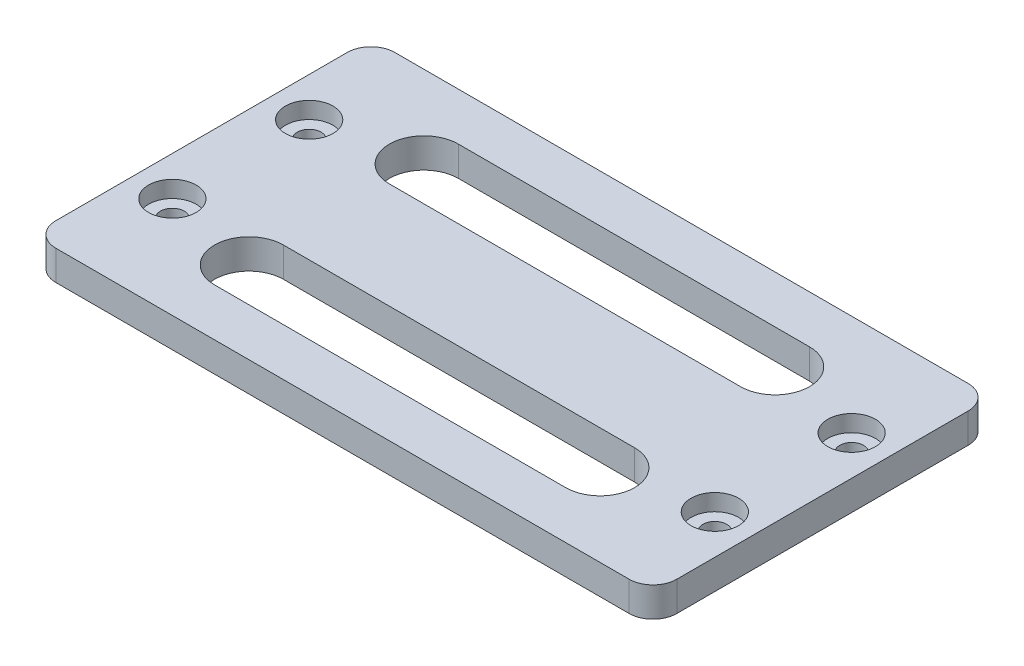
ISO-10303-21;
HEADER;
FILE_DESCRIPTION(('STEP AP214'),'2;1');
FILE_NAME('part.step','',(''),(''),'','','');
FILE_SCHEMA(('AUTOMOTIVE_DESIGN { 1 0 10303 214 1 1 1 1 }'));
ENDSEC;
DATA;
#1=APPLICATION_CONTEXT('core data for automotive mechanical design processes');
#2=APPLICATION_PROTOCOL_DEFINITION('international standard','automotive_design',2000,#1);
#3=PRODUCT_CONTEXT('',#1,'mechanical');
#4=PRODUCT('Part','Part','',(#3));
#5=PRODUCT_RELATED_PRODUCT_CATEGORY('part','',(#4));
#6=PRODUCT_DEFINITION_FORMATION('','',#4);
#7=PRODUCT_DEFINITION_CONTEXT('part definition',#1,'design');
#8=PRODUCT_DEFINITION('design','',#6,#7);
#9=PRODUCT_DEFINITION_SHAPE('','',#8);
#10=(LENGTH_UNIT() NAMED_UNIT(*) SI_UNIT(.MILLI.,.METRE.));
#11=(NAMED_UNIT(*) PLANE_ANGLE_UNIT() SI_UNIT($,.RADIAN.));
#12=(NAMED_UNIT(*) SI_UNIT($,.STERADIAN.) SOLID_ANGLE_UNIT());
#13=UNCERTAINTY_MEASURE_WITH_UNIT(LENGTH_MEASURE(1.E-05),#10,'distance_accuracy_value','');
#14=(GEOMETRIC_REPRESENTATION_CONTEXT(3) GLOBAL_UNCERTAINTY_ASSIGNED_CONTEXT((#13)) GLOBAL_UNIT_ASSIGNED_CONTEXT((#10,
#11,#12)) REPRESENTATION_CONTEXT('',''));
#15=CARTESIAN_POINT('',(0.,0.,0.));
#16=DIRECTION('',(0.,0.,1.));
#17=DIRECTION('',(1.,0.,0.));
#18=AXIS2_PLACEMENT_3D('',#15,#16,#17);
#19=CARTESIAN_POINT('',(-22.8,1.1,3.2));
#20=DIRECTION('',(0.,-1.,0.));
#21=DIRECTION('',(0.,0.,-1.));
#22=AXIS2_PLACEMENT_3D('',#19,#20,#21);
#23=CYLINDRICAL_SURFACE('',#22,1.);
#24=CARTESIAN_POINT('',(-22.8,1.1,3.2));
#25=DIRECTION('',(0.,-1.,0.));
#26=DIRECTION('',(0.,0.,-1.));
#27=AXIS2_PLACEMENT_3D('',#24,#25,#26);
#28=CIRCLE('',#27,1.);
#29=CARTESIAN_POINT('',(-22.8,1.1,2.2));
#30=VERTEX_POINT('',#29);
#31=EDGE_CURVE('E252',#30,#30,#28,.T.);
#32=ORIENTED_EDGE('',*,*,#31,.F.);
#33=EDGE_LOOP('',(#32));
#34=FACE_BOUND('',#33,.T.);
#35=CARTESIAN_POINT('',(-22.8,0.,3.2));
#36=DIRECTION('',(0.,-1.,0.));
#37=DIRECTION('',(0.,0.,-1.));
#38=AXIS2_PLACEMENT_3D('',#35,#36,#37);
#39=CIRCLE('',#38,1.);
#40=CARTESIAN_POINT('',(-22.8,0.,2.2));
#41=VERTEX_POINT('',#40);
#42=EDGE_CURVE('E247',#41,#41,#39,.F.);
#43=ORIENTED_EDGE('',*,*,#42,.F.);
#44=EDGE_LOOP('',(#43));
#45=FACE_BOUND('',#44,.T.);
#46=ADVANCED_FACE('F17',(#34,#45),#23,.F.);
#47=CARTESIAN_POINT('',(22.8,1.1,3.2));
#48=DIRECTION('',(0.,-1.,0.));
#49=DIRECTION('',(0.,0.,-1.));
#50=AXIS2_PLACEMENT_3D('',#47,#48,#49);
#51=CYLINDRICAL_SURFACE('',#50,1.);
#52=CARTESIAN_POINT('',(22.8,1.1,3.2));
#53=DIRECTION('',(0.,-1.,0.));
#54=DIRECTION('',(0.,0.,-1.));
#55=AXIS2_PLACEMENT_3D('',#52,#53,#54);
#56=CIRCLE('',#55,1.);
#57=CARTESIAN_POINT('',(22.8,1.1,2.2));
#58=VERTEX_POINT('',#57);
#59=EDGE_CURVE('E21',#58,#58,#56,.T.);
#60=ORIENTED_EDGE('',*,*,#59,.F.);
#61=EDGE_LOOP('',(#60));
#62=FACE_BOUND('',#61,.T.);
#63=CARTESIAN_POINT('',(22.8,0.,3.2));
#64=DIRECTION('',(0.,-1.,0.));
#65=DIRECTION('',(0.,0.,-1.));
#66=AXIS2_PLACEMENT_3D('',#63,#64,#65);
#67=CIRCLE('',#66,1.);
#68=CARTESIAN_POINT('',(22.8,0.,2.2));
#69=VERTEX_POINT('',#68);
#70=EDGE_CURVE('E244',#69,#69,#67,.F.);
#71=ORIENTED_EDGE('',*,*,#70,.F.);
#72=EDGE_LOOP('',(#71));
#73=FACE_BOUND('',#72,.T.);
#74=ADVANCED_FACE('F262',(#62,#73),#51,.F.);
#75=CARTESIAN_POINT('',(-22.8,1.1,-8.3));
#76=DIRECTION('',(0.,-1.,0.));
#77=DIRECTION('',(0.,0.,-1.));
#78=AXIS2_PLACEMENT_3D('',#75,#76,#77);
#79=CYLINDRICAL_SURFACE('',#78,1.);
#80=CARTESIAN_POINT('',(-22.8,1.1,-8.3));
#81=DIRECTION('',(0.,-1.,0.));
#82=DIRECTION('',(0.,0.,-1.));
#83=AXIS2_PLACEMENT_3D('',#80,#81,#82);
#84=CIRCLE('',#83,1.);
#85=CARTESIAN_POINT('',(-22.8,1.1,-9.3));
#86=VERTEX_POINT('',#85);
#87=EDGE_CURVE('E250',#86,#86,#84,.T.);
#88=ORIENTED_EDGE('',*,*,#87,.F.);
#89=EDGE_LOOP('',(#88));
#90=FACE_BOUND('',#89,.T.);
#91=CARTESIAN_POINT('',(-22.8,0.,-8.3));
#92=DIRECTION('',(0.,-1.,0.));
#93=DIRECTION('',(0.,0.,-1.));
#94=AXIS2_PLACEMENT_3D('',#91,#92,#93);
#95=CIRCLE('',#94,1.);
#96=CARTESIAN_POINT('',(-22.8,0.,-9.3));
#97=VERTEX_POINT('',#96);
#98=EDGE_CURVE('E241',#97,#97,#95,.F.);
#99=ORIENTED_EDGE('',*,*,#98,.F.);
#100=EDGE_LOOP('',(#99));
#101=FACE_BOUND('',#100,.T.);
#102=ADVANCED_FACE('F265',(#90,#101),#79,.F.);
#103=CARTESIAN_POINT('',(20.776,1.1,1.176));
#104=DIRECTION('',(0.,1.,0.));
#105=DIRECTION('',(0.,0.,1.));
#106=AXIS2_PLACEMENT_3D('',#103,#104,#105);
#107=PLANE('',#106);
#108=ORIENTED_EDGE('',*,*,#59,.T.);
#109=EDGE_LOOP('',(#108));
#110=FACE_BOUND('',#109,.T.);
#111=CARTESIAN_POINT('',(22.8,1.1,3.2));
#112=DIRECTION('',(0.,1.,0.));
#113=DIRECTION('',(0.,0.,1.));
#114=AXIS2_PLACEMENT_3D('',#111,#112,#113);
#115=CIRCLE('',#114,2.);
#116=CARTESIAN_POINT('',(22.8,1.1,5.2));
#117=VERTEX_POINT('',#116);
#118=EDGE_CURVE('E153',#117,#117,#115,.F.);
#119=ORIENTED_EDGE('',*,*,#118,.F.);
#120=EDGE_LOOP('',(#119));
#121=FACE_BOUND('',#120,.T.);
#122=ADVANCED_FACE('F259',(#110,#121),#107,.T.);
#123=CARTESIAN_POINT('',(-24.824,1.1,1.176));
#124=DIRECTION('',(0.,1.,0.));
#125=DIRECTION('',(0.,0.,1.));
#126=AXIS2_PLACEMENT_3D('',#123,#124,#125);
#127=PLANE('',#126);
#128=ORIENTED_EDGE('',*,*,#31,.T.);
#129=EDGE_LOOP('',(#128));
#130=FACE_BOUND('',#129,.T.);
#131=CARTESIAN_POINT('',(-22.8,1.1,3.2));
#132=DIRECTION('',(0.,1.,0.));
#133=DIRECTION('',(0.,0.,1.));
#134=AXIS2_PLACEMENT_3D('',#131,#132,#133);
#135=CIRCLE('',#134,2.);
#136=CARTESIAN_POINT('',(-22.8,1.1,5.2));
#137=VERTEX_POINT('',#136);
#138=EDGE_CURVE('E156',#137,#137,#135,.F.);
#139=ORIENTED_EDGE('',*,*,#138,.F.);
#140=EDGE_LOOP('',(#139));
#141=FACE_BOUND('',#140,.T.);
#142=ADVANCED_FACE('F365',(#130,#141),#127,.T.);
#143=CARTESIAN_POINT('',(-24.824,1.1,-10.324));
#144=DIRECTION('',(0.,1.,0.));
#145=DIRECTION('',(0.,0.,1.));
#146=AXIS2_PLACEMENT_3D('',#143,#144,#145);
#147=PLANE('',#146);
#148=ORIENTED_EDGE('',*,*,#87,.T.);
#149=EDGE_LOOP('',(#148));
#150=FACE_BOUND('',#149,.T.);
#151=CARTESIAN_POINT('',(-22.8,1.1,-8.3));
#152=DIRECTION('',(0.,1.,0.));
#153=DIRECTION('',(0.,0.,1.));
#154=AXIS2_PLACEMENT_3D('',#151,#152,#153);
#155=CIRCLE('',#154,2.);
#156=CARTESIAN_POINT('',(-22.8,1.1,-6.3));
#157=VERTEX_POINT('',#156);
#158=EDGE_CURVE('E229',#157,#157,#155,.F.);
#159=ORIENTED_EDGE('',*,*,#158,.F.);
#160=EDGE_LOOP('',(#159));
#161=FACE_BOUND('',#160,.T.);
#162=ADVANCED_FACE('F272',(#150,#161),#147,.T.);
#163=CARTESIAN_POINT('',(-26.1,0.,11.7));
#164=DIRECTION('',(0.,-1.,0.));
#165=DIRECTION('',(0.,0.,-1.));
#166=AXIS2_PLACEMENT_3D('',#163,#164,#165);
#167=PLANE('',#166);
#168=CARTESIAN_POINT('',(-14.760318416,0.,4.8));
#169=DIRECTION('',(0.,1.,0.));
#170=DIRECTION('',(0.,0.,1.));
#171=AXIS2_PLACEMENT_3D('',#168,#169,#170);
#172=CIRCLE('',#171,2.9);
#173=CARTESIAN_POINT('',(-14.7603184162604,0.,7.7));
#174=VERTEX_POINT('',#173);
#175=CARTESIAN_POINT('',(-14.7603184165948,0.,1.9));
#176=VERTEX_POINT('',#175);
#177=EDGE_CURVE('E216',#174,#176,#172,.F.);
#178=ORIENTED_EDGE('',*,*,#177,.F.);
#179=DIRECTION('',(-1.,0.,0.));
#180=VECTOR('',#179,1.);
#181=CARTESIAN_POINT('',(0.,0.,7.7));
#182=LINE('',#181,#180);
#183=CARTESIAN_POINT('',(14.760318416,0.,7.7));
#184=VERTEX_POINT('',#183);
#185=EDGE_CURVE('E310',#184,#174,#182,.T.);
#186=ORIENTED_EDGE('',*,*,#185,.F.);
#187=CARTESIAN_POINT('',(14.760318416,0.,4.8));
#188=DIRECTION('',(0.,1.,0.));
#189=DIRECTION('',(0.,0.,1.));
#190=AXIS2_PLACEMENT_3D('',#187,#188,#189);
#191=CIRCLE('',#190,2.9);
#192=CARTESIAN_POINT('',(14.760318416,0.,1.9));
#193=VERTEX_POINT('',#192);
#194=EDGE_CURVE('E219',#193,#184,#191,.F.);
#195=ORIENTED_EDGE('',*,*,#194,.F.);
#196=DIRECTION('',(1.,0.,0.));
#197=VECTOR('',#196,1.);
#198=CARTESIAN_POINT('',(0.,0.,1.9));
#199=LINE('',#198,#197);
#200=EDGE_CURVE('E221',#176,#193,#199,.T.);
#201=ORIENTED_EDGE('',*,*,#200,.F.);
#202=EDGE_LOOP('',(#178,#186,#195,#201));
#203=FACE_BOUND('',#202,.T.);
#204=ORIENTED_EDGE('',*,*,#98,.T.);
#205=EDGE_LOOP('',(#204));
#206=FACE_BOUND('',#205,.T.);
#207=ORIENTED_EDGE('',*,*,#70,.T.);
#208=EDGE_LOOP('',(#207));
#209=FACE_BOUND('',#208,.T.);
#210=ORIENTED_EDGE('',*,*,#42,.T.);
#211=EDGE_LOOP('',(#210));
#212=FACE_BOUND('',#211,.T.);
#213=CARTESIAN_POINT('',(22.8,0.,-8.3));
#214=DIRECTION('',(0.,-1.,0.));
#215=DIRECTION('',(0.,0.,-1.));
#216=AXIS2_PLACEMENT_3D('',#213,#214,#215);
#217=CIRCLE('',#216,1.);
#218=CARTESIAN_POINT('',(22.8,0.,-9.3));
#219=VERTEX_POINT('',#218);
#220=EDGE_CURVE('E139',#219,#219,#217,.T.);
#221=ORIENTED_EDGE('',*,*,#220,.F.);
#222=EDGE_LOOP('',(#221));
#223=FACE_BOUND('',#222,.T.);
#224=DIRECTION('',(-1.,0.,0.));
#225=VECTOR('',#224,1.);
#226=CARTESIAN_POINT('',(0.,0.,-7.));
#227=LINE('',#226,#225);
#228=CARTESIAN_POINT('',(14.760318416,0.,-7.));
#229=VERTEX_POINT('',#228);
#230=CARTESIAN_POINT('',(-14.760318416,0.,-7.));
#231=VERTEX_POINT('',#230);
#232=EDGE_CURVE('E161',#229,#231,#227,.T.);
#233=ORIENTED_EDGE('',*,*,#232,.F.);
#234=CARTESIAN_POINT('',(14.760318416,0.,-9.9));
#235=DIRECTION('',(0.,1.,0.));
#236=DIRECTION('',(0.,0.,1.));
#237=AXIS2_PLACEMENT_3D('',#234,#235,#236);
#238=CIRCLE('',#237,2.9);
#239=CARTESIAN_POINT('',(14.760318416,0.,-12.8));
#240=VERTEX_POINT('',#239);
#241=EDGE_CURVE('E223',#240,#229,#238,.F.);
#242=ORIENTED_EDGE('',*,*,#241,.F.);
#243=DIRECTION('',(1.,0.,0.));
#244=VECTOR('',#243,1.);
#245=CARTESIAN_POINT('',(0.,0.,-12.8));
#246=LINE('',#245,#244);
#247=CARTESIAN_POINT('',(-14.760318416,0.,-12.8));
#248=VERTEX_POINT('',#247);
#249=EDGE_CURVE('E225',#248,#240,#246,.T.);
#250=ORIENTED_EDGE('',*,*,#249,.F.);
#251=CARTESIAN_POINT('',(-14.760318416,0.,-9.9));
#252=DIRECTION('',(0.,1.,0.));
#253=DIRECTION('',(0.,0.,1.));
#254=AXIS2_PLACEMENT_3D('',#251,#252,#253);
#255=CIRCLE('',#254,2.9);
#256=EDGE_CURVE('E227',#231,#248,#255,.F.);
#257=ORIENTED_EDGE('',*,*,#256,.F.);
#258=EDGE_LOOP('',(#233,#242,#250,#257));
#259=FACE_BOUND('',#258,.T.);
#260=DIRECTION('',(0.,0.,-1.));
#261=VECTOR('',#260,1.);
#262=CARTESIAN_POINT('',(-26.1,0.,-2.55));
#263=LINE('',#262,#261);
#264=CARTESIAN_POINT('',(-26.1,0.,9.7));
#265=VERTEX_POINT('',#264);
#266=CARTESIAN_POINT('',(-26.1,0.,-14.7999999996153));
#267=VERTEX_POINT('',#266);
#268=EDGE_CURVE('E167',#265,#267,#263,.T.);
#269=ORIENTED_EDGE('',*,*,#268,.T.);
#270=CARTESIAN_POINT('',(-24.1,0.,-14.8));
#271=DIRECTION('',(0.,-1.,0.));
#272=DIRECTION('',(1.,0.,0.));
#273=AXIS2_PLACEMENT_3D('',#270,#271,#272);
#274=CIRCLE('',#273,2.);
#275=CARTESIAN_POINT('',(-24.1,0.,-16.8));
#276=VERTEX_POINT('',#275);
#277=EDGE_CURVE('E235',#267,#276,#274,.T.);
#278=ORIENTED_EDGE('',*,*,#277,.T.);
#279=DIRECTION('',(1.,0.,0.));
#280=VECTOR('',#279,1.);
#281=CARTESIAN_POINT('',(0.,0.,-16.8));
#282=LINE('',#281,#280);
#283=CARTESIAN_POINT('',(24.1,0.,-16.8));
#284=VERTEX_POINT('',#283);
#285=EDGE_CURVE('E163',#276,#284,#282,.T.);
#286=ORIENTED_EDGE('',*,*,#285,.T.);
#287=CARTESIAN_POINT('',(24.1,0.,-14.8));
#288=DIRECTION('',(0.,-1.,0.));
#289=DIRECTION('',(1.,0.,0.));
#290=AXIS2_PLACEMENT_3D('',#287,#288,#289);
#291=CIRCLE('',#290,2.);
#292=CARTESIAN_POINT('',(26.1,0.,-14.8));
#293=VERTEX_POINT('',#292);
#294=EDGE_CURVE('E149',#284,#293,#291,.T.);
#295=ORIENTED_EDGE('',*,*,#294,.T.);
#296=DIRECTION('',(0.,0.,1.));
#297=VECTOR('',#296,1.);
#298=CARTESIAN_POINT('',(26.1,0.,-2.55));
#299=LINE('',#298,#297);
#300=CARTESIAN_POINT('',(26.1,0.,9.7));
#301=VERTEX_POINT('',#300);
#302=EDGE_CURVE('E144',#293,#301,#299,.T.);
#303=ORIENTED_EDGE('',*,*,#302,.T.);
#304=CARTESIAN_POINT('',(24.1,0.,9.7));
#305=DIRECTION('',(0.,-1.,0.));
#306=DIRECTION('',(1.,0.,0.));
#307=AXIS2_PLACEMENT_3D('',#304,#305,#306);
#308=CIRCLE('',#307,2.);
#309=CARTESIAN_POINT('',(24.1,0.,11.7));
#310=VERTEX_POINT('',#309);
#311=EDGE_CURVE('E129',#301,#310,#308,.T.);
#312=ORIENTED_EDGE('',*,*,#311,.T.);
#313=DIRECTION('',(-1.,0.,0.));
#314=VECTOR('',#313,1.);
#315=CARTESIAN_POINT('',(0.,0.,11.7));
#316=LINE('',#315,#314);
#317=CARTESIAN_POINT('',(-24.1000000004102,0.,11.7));
#318=VERTEX_POINT('',#317);
#319=EDGE_CURVE('E171',#310,#318,#316,.T.);
#320=ORIENTED_EDGE('',*,*,#319,.T.);
#321=CARTESIAN_POINT('',(-24.1,0.,9.7));
#322=DIRECTION('',(0.,-1.,0.));
#323=DIRECTION('',(1.,0.,0.));
#324=AXIS2_PLACEMENT_3D('',#321,#322,#323);
#325=CIRCLE('',#324,2.);
#326=EDGE_CURVE('E237',#318,#265,#325,.T.);
#327=ORIENTED_EDGE('',*,*,#326,.T.);
#328=EDGE_LOOP('',(#269,#278,#286,#295,#303,#312,#320,#327));
#329=FACE_BOUND('',#328,.T.);
#330=ADVANCED_FACE('F151',(#203,#206,#209,#212,#223,#259,#329),#167,.T.);
#331=CARTESIAN_POINT('',(22.8,1.1,-8.3));
#332=DIRECTION('',(0.,-1.,0.));
#333=DIRECTION('',(0.,0.,-1.));
#334=AXIS2_PLACEMENT_3D('',#331,#332,#333);
#335=CYLINDRICAL_SURFACE('',#334,1.);
#336=CARTESIAN_POINT('',(22.8,1.1,-8.3));
#337=DIRECTION('',(0.,-1.,0.));
#338=DIRECTION('',(0.,0.,-1.));
#339=AXIS2_PLACEMENT_3D('',#336,#337,#338);
#340=CIRCLE('',#339,1.);
#341=CARTESIAN_POINT('',(22.8,1.1,-9.3));
#342=VERTEX_POINT('',#341);
#343=EDGE_CURVE('E213',#342,#342,#340,.T.);
#344=ORIENTED_EDGE('',*,*,#343,.F.);
#345=EDGE_LOOP('',(#344));
#346=FACE_BOUND('',#345,.T.);
#347=ORIENTED_EDGE('',*,*,#220,.T.);
#348=EDGE_LOOP('',(#347));
#349=FACE_BOUND('',#348,.T.);
#350=ADVANCED_FACE('F271',(#346,#349),#335,.F.);
#351=CARTESIAN_POINT('',(24.1,2.5,9.7));
#352=DIRECTION('',(0.,-1.,0.));
#353=DIRECTION('',(1.,0.,0.));
#354=AXIS2_PLACEMENT_3D('',#351,#352,#353);
#355=CYLINDRICAL_SURFACE('',#354,2.);
#356=DIRECTION('',(0.,-1.,0.));
#357=VECTOR('',#356,1.);
#358=CARTESIAN_POINT('',(24.1,1.25,11.7));
#359=LINE('',#358,#357);
#360=CARTESIAN_POINT('',(24.1,2.5,11.7));
#361=VERTEX_POINT('',#360);
#362=EDGE_CURVE('E135',#361,#310,#359,.T.);
#363=ORIENTED_EDGE('',*,*,#362,.T.);
#364=ORIENTED_EDGE('',*,*,#311,.F.);
#365=DIRECTION('',(0.,1.,0.));
#366=VECTOR('',#365,1.);
#367=CARTESIAN_POINT('',(26.1,1.25,9.7));
#368=LINE('',#367,#366);
#369=CARTESIAN_POINT('',(26.1,2.5,9.7));
#370=VERTEX_POINT('',#369);
#371=EDGE_CURVE('E133',#301,#370,#368,.T.);
#372=ORIENTED_EDGE('',*,*,#371,.T.);
#373=CARTESIAN_POINT('',(24.1,2.5,9.7));
#374=DIRECTION('',(0.,-1.,0.));
#375=DIRECTION('',(1.,0.,0.));
#376=AXIS2_PLACEMENT_3D('',#373,#374,#375);
#377=CIRCLE('',#376,2.);
#378=EDGE_CURVE('E211',#370,#361,#377,.T.);
#379=ORIENTED_EDGE('',*,*,#378,.T.);
#380=EDGE_LOOP('',(#363,#364,#372,#379));
#381=FACE_BOUND('',#380,.T.);
#382=ADVANCED_FACE('F131',(#381),#355,.T.);
#383=CARTESIAN_POINT('',(24.1,0.,11.7));
#384=DIRECTION('',(0.,0.,-1.));
#385=DIRECTION('',(-1.,0.,0.));
#386=AXIS2_PLACEMENT_3D('',#383,#384,#385);
#387=PLANE('',#386);
#388=ORIENTED_EDGE('',*,*,#362,.F.);
#389=DIRECTION('',(-1.,0.,0.));
#390=VECTOR('',#389,1.);
#391=CARTESIAN_POINT('',(0.,2.5,11.7));
#392=LINE('',#391,#390);
#393=CARTESIAN_POINT('',(-24.1000000004102,2.5,11.7));
#394=VERTEX_POINT('',#393);
#395=EDGE_CURVE('E210',#361,#394,#392,.T.);
#396=ORIENTED_EDGE('',*,*,#395,.T.);
#397=DIRECTION('',(0.,1.,0.));
#398=VECTOR('',#397,1.);
#399=CARTESIAN_POINT('',(-24.1000000008204,1.25,11.7));
#400=LINE('',#399,#398);
#401=EDGE_CURVE('E172',#394,#318,#400,.F.);
#402=ORIENTED_EDGE('',*,*,#401,.T.);
#403=ORIENTED_EDGE('',*,*,#319,.F.);
#404=EDGE_LOOP('',(#388,#396,#402,#403));
#405=FACE_BOUND('',#404,.T.);
#406=ADVANCED_FACE('F416',(#405),#387,.F.);
#407=CARTESIAN_POINT('',(-24.1,2.5,9.7));
#408=DIRECTION('',(0.,-1.,0.));
#409=DIRECTION('',(1.,0.,0.));
#410=AXIS2_PLACEMENT_3D('',#407,#408,#409);
#411=CYLINDRICAL_SURFACE('',#410,2.);
#412=DIRECTION('',(0.,-1.,0.));
#413=VECTOR('',#412,1.);
#414=CARTESIAN_POINT('',(-26.1,1.25,9.7));
#415=LINE('',#414,#413);
#416=CARTESIAN_POINT('',(-26.1,2.5,9.7));
#417=VERTEX_POINT('',#416);
#418=EDGE_CURVE('E170',#417,#265,#415,.T.);
#419=ORIENTED_EDGE('',*,*,#418,.T.);
#420=ORIENTED_EDGE('',*,*,#326,.F.);
#421=ORIENTED_EDGE('',*,*,#401,.F.);
#422=CARTESIAN_POINT('',(-24.1,2.5,9.7));
#423=DIRECTION('',(0.,-1.,0.));
#424=DIRECTION('',(1.,0.,0.));
#425=AXIS2_PLACEMENT_3D('',#422,#423,#424);
#426=CIRCLE('',#425,2.);
#427=EDGE_CURVE('E207',#394,#417,#426,.T.);
#428=ORIENTED_EDGE('',*,*,#427,.T.);
#429=EDGE_LOOP('',(#419,#420,#421,#428));
#430=FACE_BOUND('',#429,.T.);
#431=ADVANCED_FACE('F413',(#430),#411,.T.);
#432=CARTESIAN_POINT('',(-26.1,0.,9.7));
#433=DIRECTION('',(1.,0.,0.));
#434=DIRECTION('',(0.,0.,-1.));
#435=AXIS2_PLACEMENT_3D('',#432,#433,#434);
#436=PLANE('',#435);
#437=ORIENTED_EDGE('',*,*,#418,.F.);
#438=DIRECTION('',(0.,0.,-1.));
#439=VECTOR('',#438,1.);
#440=CARTESIAN_POINT('',(-26.1,2.5,-2.55));
#441=LINE('',#440,#439);
#442=CARTESIAN_POINT('',(-26.1,2.5,-14.7999999996153));
#443=VERTEX_POINT('',#442);
#444=EDGE_CURVE('E206',#417,#443,#441,.T.);
#445=ORIENTED_EDGE('',*,*,#444,.T.);
#446=DIRECTION('',(0.,1.,0.));
#447=VECTOR('',#446,1.);
#448=CARTESIAN_POINT('',(-26.1,1.25,-14.7999999992306));
#449=LINE('',#448,#447);
#450=EDGE_CURVE('E169',#443,#267,#449,.F.);
#451=ORIENTED_EDGE('',*,*,#450,.T.);
#452=ORIENTED_EDGE('',*,*,#268,.F.);
#453=EDGE_LOOP('',(#437,#445,#451,#452));
#454=FACE_BOUND('',#453,.T.);
#455=ADVANCED_FACE('F411',(#454),#436,.F.);
#456=CARTESIAN_POINT('',(-24.1,2.5,-14.8));
#457=DIRECTION('',(0.,-1.,0.));
#458=DIRECTION('',(1.,0.,0.));
#459=AXIS2_PLACEMENT_3D('',#456,#457,#458);
#460=CYLINDRICAL_SURFACE('',#459,2.);
#461=DIRECTION('',(0.,-1.,0.));
#462=VECTOR('',#461,1.);
#463=CARTESIAN_POINT('',(-24.1,1.25,-16.8));
#464=LINE('',#463,#462);
#465=CARTESIAN_POINT('',(-24.1,2.5,-16.8));
#466=VERTEX_POINT('',#465);
#467=EDGE_CURVE('E166',#466,#276,#464,.T.);
#468=ORIENTED_EDGE('',*,*,#467,.T.);
#469=ORIENTED_EDGE('',*,*,#277,.F.);
#470=ORIENTED_EDGE('',*,*,#450,.F.);
#471=CARTESIAN_POINT('',(-24.1,2.5,-14.8));
#472=DIRECTION('',(0.,-1.,0.));
#473=DIRECTION('',(1.,0.,0.));
#474=AXIS2_PLACEMENT_3D('',#471,#472,#473);
#475=CIRCLE('',#474,2.);
#476=EDGE_CURVE('E203',#443,#466,#475,.T.);
#477=ORIENTED_EDGE('',*,*,#476,.T.);
#478=EDGE_LOOP('',(#468,#469,#470,#477));
#479=FACE_BOUND('',#478,.T.);
#480=ADVANCED_FACE('F408',(#479),#460,.T.);
#481=CARTESIAN_POINT('',(-24.1,0.,-16.8));
#482=DIRECTION('',(0.,0.,1.));
#483=DIRECTION('',(1.,0.,0.));
#484=AXIS2_PLACEMENT_3D('',#481,#482,#483);
#485=PLANE('',#484);
#486=DIRECTION('',(0.,1.,0.));
#487=VECTOR('',#486,1.);
#488=CARTESIAN_POINT('',(24.1,1.25,-16.8));
#489=LINE('',#488,#487);
#490=CARTESIAN_POINT('',(24.1,2.5,-16.8));
#491=VERTEX_POINT('',#490);
#492=EDGE_CURVE('E165',#491,#284,#489,.F.);
#493=ORIENTED_EDGE('',*,*,#492,.T.);
#494=ORIENTED_EDGE('',*,*,#285,.F.);
#495=ORIENTED_EDGE('',*,*,#467,.F.);
#496=DIRECTION('',(1.,0.,0.));
#497=VECTOR('',#496,1.);
#498=CARTESIAN_POINT('',(0.,2.5,-16.8));
#499=LINE('',#498,#497);
#500=EDGE_CURVE('E202',#466,#491,#499,.T.);
#501=ORIENTED_EDGE('',*,*,#500,.T.);
#502=EDGE_LOOP('',(#493,#494,#495,#501));
#503=FACE_BOUND('',#502,.T.);
#504=ADVANCED_FACE('F406',(#503),#485,.F.);
#505=CARTESIAN_POINT('',(24.1,2.5,-14.8));
#506=DIRECTION('',(0.,-1.,0.));
#507=DIRECTION('',(1.,0.,0.));
#508=AXIS2_PLACEMENT_3D('',#505,#506,#507);
#509=CYLINDRICAL_SURFACE('',#508,2.);
#510=DIRECTION('',(0.,-1.,0.));
#511=VECTOR('',#510,1.);
#512=CARTESIAN_POINT('',(26.1,1.25,-14.8));
#513=LINE('',#512,#511);
#514=CARTESIAN_POINT('',(26.1,2.5,-14.8));
#515=VERTEX_POINT('',#514);
#516=EDGE_CURVE('E148',#515,#293,#513,.T.);
#517=ORIENTED_EDGE('',*,*,#516,.T.);
#518=ORIENTED_EDGE('',*,*,#294,.F.);
#519=ORIENTED_EDGE('',*,*,#492,.F.);
#520=CARTESIAN_POINT('',(24.1,2.5,-14.8));
#521=DIRECTION('',(0.,-1.,0.));
#522=DIRECTION('',(1.,0.,0.));
#523=AXIS2_PLACEMENT_3D('',#520,#521,#522);
#524=CIRCLE('',#523,2.);
#525=EDGE_CURVE('E199',#491,#515,#524,.T.);
#526=ORIENTED_EDGE('',*,*,#525,.T.);
#527=EDGE_LOOP('',(#517,#518,#519,#526));
#528=FACE_BOUND('',#527,.T.);
#529=ADVANCED_FACE('F403',(#528),#509,.T.);
#530=CARTESIAN_POINT('',(26.1,0.,-14.8));
#531=DIRECTION('',(-1.,0.,0.));
#532=DIRECTION('',(0.,0.,1.));
#533=AXIS2_PLACEMENT_3D('',#530,#531,#532);
#534=PLANE('',#533);
#535=ORIENTED_EDGE('',*,*,#516,.F.);
#536=DIRECTION('',(0.,0.,1.));
#537=VECTOR('',#536,1.);
#538=CARTESIAN_POINT('',(26.1,2.5,-2.55));
#539=LINE('',#538,#537);
#540=EDGE_CURVE('E147',#515,#370,#539,.T.);
#541=ORIENTED_EDGE('',*,*,#540,.T.);
#542=ORIENTED_EDGE('',*,*,#371,.F.);
#543=ORIENTED_EDGE('',*,*,#302,.F.);
#544=EDGE_LOOP('',(#535,#541,#542,#543));
#545=FACE_BOUND('',#544,.T.);
#546=ADVANCED_FACE('F143',(#545),#534,.F.);
#547=CARTESIAN_POINT('',(22.8,1.1,3.2));
#548=DIRECTION('',(0.,1.,0.));
#549=DIRECTION('',(0.,0.,1.));
#550=AXIS2_PLACEMENT_3D('',#547,#548,#549);
#551=CYLINDRICAL_SURFACE('',#550,2.);
#552=ORIENTED_EDGE('',*,*,#118,.T.);
#553=EDGE_LOOP('',(#552));
#554=FACE_BOUND('',#553,.T.);
#555=CARTESIAN_POINT('',(22.8,2.5,3.2));
#556=DIRECTION('',(0.,1.,0.));
#557=DIRECTION('',(0.,0.,1.));
#558=AXIS2_PLACEMENT_3D('',#555,#556,#557);
#559=CIRCLE('',#558,2.);
#560=CARTESIAN_POINT('',(22.8,2.5,5.2));
#561=VERTEX_POINT('',#560);
#562=EDGE_CURVE('E196',#561,#561,#559,.T.);
#563=ORIENTED_EDGE('',*,*,#562,.T.);
#564=EDGE_LOOP('',(#563));
#565=FACE_BOUND('',#564,.T.);
#566=ADVANCED_FACE('F398',(#554,#565),#551,.F.);
#567=CARTESIAN_POINT('',(-22.8,1.1,3.2));
#568=DIRECTION('',(0.,1.,0.));
#569=DIRECTION('',(0.,0.,1.));
#570=AXIS2_PLACEMENT_3D('',#567,#568,#569);
#571=CYLINDRICAL_SURFACE('',#570,2.);
#572=ORIENTED_EDGE('',*,*,#138,.T.);
#573=EDGE_LOOP('',(#572));
#574=FACE_BOUND('',#573,.T.);
#575=CARTESIAN_POINT('',(-22.8,2.5,3.2));
#576=DIRECTION('',(0.,1.,0.));
#577=DIRECTION('',(0.,0.,1.));
#578=AXIS2_PLACEMENT_3D('',#575,#576,#577);
#579=CIRCLE('',#578,2.);
#580=CARTESIAN_POINT('',(-22.8,2.5,5.2));
#581=VERTEX_POINT('',#580);
#582=EDGE_CURVE('E193',#581,#581,#579,.T.);
#583=ORIENTED_EDGE('',*,*,#582,.T.);
#584=EDGE_LOOP('',(#583));
#585=FACE_BOUND('',#584,.T.);
#586=ADVANCED_FACE('F394',(#574,#585),#571,.F.);
#587=CARTESIAN_POINT('',(-22.8,1.1,-8.3));
#588=DIRECTION('',(0.,1.,0.));
#589=DIRECTION('',(0.,0.,1.));
#590=AXIS2_PLACEMENT_3D('',#587,#588,#589);
#591=CYLINDRICAL_SURFACE('',#590,2.);
#592=ORIENTED_EDGE('',*,*,#158,.T.);
#593=EDGE_LOOP('',(#592));
#594=FACE_BOUND('',#593,.T.);
#595=CARTESIAN_POINT('',(-22.8,2.5,-8.3));
#596=DIRECTION('',(0.,1.,0.));
#597=DIRECTION('',(0.,0.,1.));
#598=AXIS2_PLACEMENT_3D('',#595,#596,#597);
#599=CIRCLE('',#598,2.);
#600=CARTESIAN_POINT('',(-22.8,2.5,-6.3));
#601=VERTEX_POINT('',#600);
#602=EDGE_CURVE('E190',#601,#601,#599,.T.);
#603=ORIENTED_EDGE('',*,*,#602,.T.);
#604=EDGE_LOOP('',(#603));
#605=FACE_BOUND('',#604,.T.);
#606=ADVANCED_FACE('F390',(#594,#605),#591,.F.);
#607=CARTESIAN_POINT('',(-14.760318416,0.,-9.9));
#608=DIRECTION('',(0.,1.,0.));
#609=DIRECTION('',(0.,0.,1.));
#610=AXIS2_PLACEMENT_3D('',#607,#608,#609);
#611=CYLINDRICAL_SURFACE('',#610,2.9);
#612=ORIENTED_EDGE('',*,*,#256,.T.);
#613=DIRECTION('',(0.,-1.,0.));
#614=VECTOR('',#613,1.);
#615=CARTESIAN_POINT('',(-14.760318416,1.25,-12.8));
#616=LINE('',#615,#614);
#617=CARTESIAN_POINT('',(-14.760318416,2.5,-12.80000000275));
#618=VERTEX_POINT('',#617);
#619=EDGE_CURVE('E296',#618,#248,#616,.T.);
#620=ORIENTED_EDGE('',*,*,#619,.F.);
#621=CARTESIAN_POINT('',(-14.760318416,2.5,-9.9));
#622=DIRECTION('',(0.,1.,0.));
#623=DIRECTION('',(0.,0.,1.));
#624=AXIS2_PLACEMENT_3D('',#621,#622,#623);
#625=CIRCLE('',#624,2.9);
#626=CARTESIAN_POINT('',(-14.760318416,2.5,-7.00000000175));
#627=VERTEX_POINT('',#626);
#628=EDGE_CURVE('E187',#618,#627,#625,.T.);
#629=ORIENTED_EDGE('',*,*,#628,.T.);
#630=DIRECTION('',(0.,1.,0.));
#631=VECTOR('',#630,1.);
#632=CARTESIAN_POINT('',(-14.760318416,1.25,-7.));
#633=LINE('',#632,#631);
#634=EDGE_CURVE('E287',#231,#627,#633,.T.);
#635=ORIENTED_EDGE('',*,*,#634,.F.);
#636=EDGE_LOOP('',(#612,#620,#629,#635));
#637=FACE_BOUND('',#636,.T.);
#638=ADVANCED_FACE('F387',(#637),#611,.F.);
#639=CARTESIAN_POINT('',(14.760318416,0.,-7.));
#640=DIRECTION('',(0.,0.,-1.));
#641=DIRECTION('',(-1.,0.,0.));
#642=AXIS2_PLACEMENT_3D('',#639,#640,#641);
#643=PLANE('',#642);
#644=ORIENTED_EDGE('',*,*,#232,.T.);
#645=ORIENTED_EDGE('',*,*,#634,.T.);
#646=DIRECTION('',(1.,0.,0.));
#647=VECTOR('',#646,1.);
#648=CARTESIAN_POINT('',(0.,2.5,-7.00000000350001));
#649=LINE('',#648,#647);
#650=CARTESIAN_POINT('',(14.760318416,2.5,-7.00000000175));
#651=VERTEX_POINT('',#650);
#652=EDGE_CURVE('E186',#627,#651,#649,.T.);
#653=ORIENTED_EDGE('',*,*,#652,.T.);
#654=DIRECTION('',(0.,-1.,0.));
#655=VECTOR('',#654,1.);
#656=CARTESIAN_POINT('',(14.760318416,1.25,-7.));
#657=LINE('',#656,#655);
#658=EDGE_CURVE('E226',#229,#651,#657,.F.);
#659=ORIENTED_EDGE('',*,*,#658,.F.);
#660=EDGE_LOOP('',(#644,#645,#653,#659));
#661=FACE_BOUND('',#660,.T.);
#662=ADVANCED_FACE('F290',(#661),#643,.T.);
#663=CARTESIAN_POINT('',(14.760318416,0.,-9.9));
#664=DIRECTION('',(0.,1.,0.));
#665=DIRECTION('',(0.,0.,1.));
#666=AXIS2_PLACEMENT_3D('',#663,#664,#665);
#667=CYLINDRICAL_SURFACE('',#666,2.9);
#668=DIRECTION('',(0.,1.,0.));
#669=VECTOR('',#668,1.);
#670=CARTESIAN_POINT('',(14.760318416,1.25,-12.8));
#671=LINE('',#670,#669);
#672=CARTESIAN_POINT('',(14.760318416,2.5,-12.80000000275));
#673=VERTEX_POINT('',#672);
#674=EDGE_CURVE('E313',#240,#673,#671,.T.);
#675=ORIENTED_EDGE('',*,*,#674,.F.);
#676=ORIENTED_EDGE('',*,*,#241,.T.);
#677=ORIENTED_EDGE('',*,*,#658,.T.);
#678=CARTESIAN_POINT('',(14.760318416,2.5,-9.9));
#679=DIRECTION('',(0.,1.,0.));
#680=DIRECTION('',(0.,0.,1.));
#681=AXIS2_PLACEMENT_3D('',#678,#679,#680);
#682=CIRCLE('',#681,2.9);
#683=EDGE_CURVE('E182',#651,#673,#682,.T.);
#684=ORIENTED_EDGE('',*,*,#683,.T.);
#685=EDGE_LOOP('',(#675,#676,#677,#684));
#686=FACE_BOUND('',#685,.T.);
#687=ADVANCED_FACE('F383',(#686),#667,.F.);
#688=CARTESIAN_POINT('',(-14.760318416,0.,-12.8));
#689=DIRECTION('',(0.,0.,1.));
#690=DIRECTION('',(1.,0.,0.));
#691=AXIS2_PLACEMENT_3D('',#688,#689,#690);
#692=PLANE('',#691);
#693=DIRECTION('',(-1.,0.,0.));
#694=VECTOR('',#693,1.);
#695=CARTESIAN_POINT('',(0.,2.5,-12.8000000055));
#696=LINE('',#695,#694);
#697=EDGE_CURVE('E185',#673,#618,#696,.T.);
#698=ORIENTED_EDGE('',*,*,#697,.T.);
#699=ORIENTED_EDGE('',*,*,#619,.T.);
#700=ORIENTED_EDGE('',*,*,#249,.T.);
#701=ORIENTED_EDGE('',*,*,#674,.T.);
#702=EDGE_LOOP('',(#698,#699,#700,#701));
#703=FACE_BOUND('',#702,.T.);
#704=ADVANCED_FACE('F386',(#703),#692,.T.);
#705=CARTESIAN_POINT('',(14.760318416,0.,7.7));
#706=DIRECTION('',(0.,0.,-1.));
#707=DIRECTION('',(-1.,0.,0.));
#708=AXIS2_PLACEMENT_3D('',#705,#706,#707);
#709=PLANE('',#708);
#710=ORIENTED_EDGE('',*,*,#185,.T.);
#711=DIRECTION('',(0.,1.,0.));
#712=VECTOR('',#711,1.);
#713=CARTESIAN_POINT('',(-14.7603184165208,1.25,7.7));
#714=LINE('',#713,#712);
#715=CARTESIAN_POINT('',(-14.7603184162604,2.5,7.70000000275));
#716=VERTEX_POINT('',#715);
#717=EDGE_CURVE('E218',#716,#174,#714,.F.);
#718=ORIENTED_EDGE('',*,*,#717,.F.);
#719=DIRECTION('',(1.,0.,0.));
#720=VECTOR('',#719,1.);
#721=CARTESIAN_POINT('',(0.,2.5,7.7000000055));
#722=LINE('',#721,#720);
#723=CARTESIAN_POINT('',(14.760318416,2.5,7.70000000275));
#724=VERTEX_POINT('',#723);
#725=EDGE_CURVE('E181',#716,#724,#722,.T.);
#726=ORIENTED_EDGE('',*,*,#725,.T.);
#727=DIRECTION('',(0.,-1.,0.));
#728=VECTOR('',#727,1.);
#729=CARTESIAN_POINT('',(14.760318416,1.25,7.7));
#730=LINE('',#729,#728);
#731=EDGE_CURVE('E222',#184,#724,#730,.F.);
#732=ORIENTED_EDGE('',*,*,#731,.F.);
#733=EDGE_LOOP('',(#710,#718,#726,#732));
#734=FACE_BOUND('',#733,.T.);
#735=ADVANCED_FACE('F350',(#734),#709,.T.);
#736=CARTESIAN_POINT('',(14.760318416,0.,4.8));
#737=DIRECTION('',(0.,1.,0.));
#738=DIRECTION('',(0.,0.,1.));
#739=AXIS2_PLACEMENT_3D('',#736,#737,#738);
#740=CYLINDRICAL_SURFACE('',#739,2.9);
#741=DIRECTION('',(0.,1.,0.));
#742=VECTOR('',#741,1.);
#743=CARTESIAN_POINT('',(14.760318416,1.25,1.9));
#744=LINE('',#743,#742);
#745=CARTESIAN_POINT('',(14.760318416,2.5,1.90000000175));
#746=VERTEX_POINT('',#745);
#747=EDGE_CURVE('E312',#193,#746,#744,.T.);
#748=ORIENTED_EDGE('',*,*,#747,.F.);
#749=ORIENTED_EDGE('',*,*,#194,.T.);
#750=ORIENTED_EDGE('',*,*,#731,.T.);
#751=CARTESIAN_POINT('',(14.760318416,2.5,4.8));
#752=DIRECTION('',(0.,1.,0.));
#753=DIRECTION('',(0.,0.,1.));
#754=AXIS2_PLACEMENT_3D('',#751,#752,#753);
#755=CIRCLE('',#754,2.9);
#756=EDGE_CURVE('E178',#724,#746,#755,.T.);
#757=ORIENTED_EDGE('',*,*,#756,.T.);
#758=EDGE_LOOP('',(#748,#749,#750,#757));
#759=FACE_BOUND('',#758,.T.);
#760=ADVANCED_FACE('F344',(#759),#740,.F.);
#761=CARTESIAN_POINT('',(-14.760318416,0.,1.9));
#762=DIRECTION('',(0.,0.,1.));
#763=DIRECTION('',(1.,0.,0.));
#764=AXIS2_PLACEMENT_3D('',#761,#762,#763);
#765=PLANE('',#764);
#766=DIRECTION('',(-1.,0.,0.));
#767=VECTOR('',#766,1.);
#768=CARTESIAN_POINT('',(0.,2.5,1.9000000035));
#769=LINE('',#768,#767);
#770=CARTESIAN_POINT('',(-14.7603184165948,2.5,1.90000000175));
#771=VERTEX_POINT('',#770);
#772=EDGE_CURVE('E177',#746,#771,#769,.T.);
#773=ORIENTED_EDGE('',*,*,#772,.T.);
#774=DIRECTION('',(0.,-1.,0.));
#775=VECTOR('',#774,1.);
#776=CARTESIAN_POINT('',(-14.7603184171896,1.25,1.9));
#777=LINE('',#776,#775);
#778=EDGE_CURVE('E322',#176,#771,#777,.F.);
#779=ORIENTED_EDGE('',*,*,#778,.F.);
#780=ORIENTED_EDGE('',*,*,#200,.T.);
#781=ORIENTED_EDGE('',*,*,#747,.T.);
#782=EDGE_LOOP('',(#773,#779,#780,#781));
#783=FACE_BOUND('',#782,.T.);
#784=ADVANCED_FACE('F340',(#783),#765,.T.);
#785=CARTESIAN_POINT('',(-14.760318416,0.,4.8));
#786=DIRECTION('',(0.,1.,0.));
#787=DIRECTION('',(0.,0.,1.));
#788=AXIS2_PLACEMENT_3D('',#785,#786,#787);
#789=CYLINDRICAL_SURFACE('',#788,2.9);
#790=ORIENTED_EDGE('',*,*,#177,.T.);
#791=ORIENTED_EDGE('',*,*,#778,.T.);
#792=CARTESIAN_POINT('',(-14.760318416,2.5,4.8));
#793=DIRECTION('',(0.,1.,0.));
#794=DIRECTION('',(0.,0.,1.));
#795=AXIS2_PLACEMENT_3D('',#792,#793,#794);
#796=CIRCLE('',#795,2.9);
#797=EDGE_CURVE('E36',#771,#716,#796,.T.);
#798=ORIENTED_EDGE('',*,*,#797,.T.);
#799=ORIENTED_EDGE('',*,*,#717,.T.);
#800=EDGE_LOOP('',(#790,#791,#798,#799));
#801=FACE_BOUND('',#800,.T.);
#802=ADVANCED_FACE('F353',(#801),#789,.F.);
#803=CARTESIAN_POINT('',(20.776,1.1,-10.324));
#804=DIRECTION('',(0.,1.,0.));
#805=DIRECTION('',(0.,0.,1.));
#806=AXIS2_PLACEMENT_3D('',#803,#804,#805);
#807=PLANE('',#806);
#808=ORIENTED_EDGE('',*,*,#343,.T.);
#809=EDGE_LOOP('',(#808));
#810=FACE_BOUND('',#809,.T.);
#811=CARTESIAN_POINT('',(22.8,1.1,-8.3));
#812=DIRECTION('',(0.,1.,0.));
#813=DIRECTION('',(0.,0.,1.));
#814=AXIS2_PLACEMENT_3D('',#811,#812,#813);
#815=CIRCLE('',#814,2.);
#816=CARTESIAN_POINT('',(22.8,1.1,-6.3));
#817=VERTEX_POINT('',#816);
#818=EDGE_CURVE('E27',#817,#817,#815,.F.);
#819=ORIENTED_EDGE('',*,*,#818,.F.);
#820=EDGE_LOOP('',(#819));
#821=FACE_BOUND('',#820,.T.);
#822=ADVANCED_FACE('F376',(#810,#821),#807,.T.);
#823=CARTESIAN_POINT('',(-26.1,2.5,11.7));
#824=DIRECTION('',(0.,-1.,0.));
#825=DIRECTION('',(0.,0.,-1.));
#826=AXIS2_PLACEMENT_3D('',#823,#824,#825);
#827=PLANE('',#826);
#828=ORIENTED_EDGE('',*,*,#797,.F.);
#829=ORIENTED_EDGE('',*,*,#772,.F.);
#830=ORIENTED_EDGE('',*,*,#756,.F.);
#831=ORIENTED_EDGE('',*,*,#725,.F.);
#832=EDGE_LOOP('',(#828,#829,#830,#831));
#833=FACE_BOUND('',#832,.T.);
#834=ORIENTED_EDGE('',*,*,#683,.F.);
#835=ORIENTED_EDGE('',*,*,#652,.F.);
#836=ORIENTED_EDGE('',*,*,#628,.F.);
#837=ORIENTED_EDGE('',*,*,#697,.F.);
#838=EDGE_LOOP('',(#834,#835,#836,#837));
#839=FACE_BOUND('',#838,.T.);
#840=ORIENTED_EDGE('',*,*,#602,.F.);
#841=EDGE_LOOP('',(#840));
#842=FACE_BOUND('',#841,.T.);
#843=ORIENTED_EDGE('',*,*,#582,.F.);
#844=EDGE_LOOP('',(#843));
#845=FACE_BOUND('',#844,.T.);
#846=ORIENTED_EDGE('',*,*,#562,.F.);
#847=EDGE_LOOP('',(#846));
#848=FACE_BOUND('',#847,.T.);
#849=CARTESIAN_POINT('',(22.8,2.5,-8.3));
#850=DIRECTION('',(0.,1.,0.));
#851=DIRECTION('',(0.,0.,1.));
#852=AXIS2_PLACEMENT_3D('',#849,#850,#851);
#853=CIRCLE('',#852,2.);
#854=CARTESIAN_POINT('',(22.8,2.5,-6.3));
#855=VERTEX_POINT('',#854);
#856=EDGE_CURVE('E11',#855,#855,#853,.T.);
#857=ORIENTED_EDGE('',*,*,#856,.F.);
#858=EDGE_LOOP('',(#857));
#859=FACE_BOUND('',#858,.T.);
#860=ORIENTED_EDGE('',*,*,#525,.F.);
#861=ORIENTED_EDGE('',*,*,#500,.F.);
#862=ORIENTED_EDGE('',*,*,#476,.F.);
#863=ORIENTED_EDGE('',*,*,#444,.F.);
#864=ORIENTED_EDGE('',*,*,#427,.F.);
#865=ORIENTED_EDGE('',*,*,#395,.F.);
#866=ORIENTED_EDGE('',*,*,#378,.F.);
#867=ORIENTED_EDGE('',*,*,#540,.F.);
#868=EDGE_LOOP('',(#860,#861,#862,#863,#864,#865,#866,#867));
#869=FACE_BOUND('',#868,.T.);
#870=ADVANCED_FACE('F19',(#833,#839,#842,#845,#848,#859,#869),#827,.F.);
#871=CARTESIAN_POINT('',(22.8,1.1,-8.3));
#872=DIRECTION('',(0.,1.,0.));
#873=DIRECTION('',(0.,0.,1.));
#874=AXIS2_PLACEMENT_3D('',#871,#872,#873);
#875=CYLINDRICAL_SURFACE('',#874,2.);
#876=ORIENTED_EDGE('',*,*,#818,.T.);
#877=EDGE_LOOP('',(#876));
#878=FACE_BOUND('',#877,.T.);
#879=ORIENTED_EDGE('',*,*,#856,.T.);
#880=EDGE_LOOP('',(#879));
#881=FACE_BOUND('',#880,.T.);
#882=ADVANCED_FACE('F369',(#878,#881),#875,.F.);
#883=CLOSED_SHELL('',(#46,#74,#102,#122,#142,#162,#330,#350,#382,#406,#431,#455,#480,#504,#529,
#546,#566,#586,#606,#638,#662,#687,#704,#735,#760,#784,#802,#822,#870,#882));
#884=MANIFOLD_SOLID_BREP('B1',#883);
#885=ADVANCED_BREP_SHAPE_REPRESENTATION('',(#18,#884),#14);
#886=SHAPE_DEFINITION_REPRESENTATION(#9,#885);
ENDSEC;
END-ISO-10303-21;
